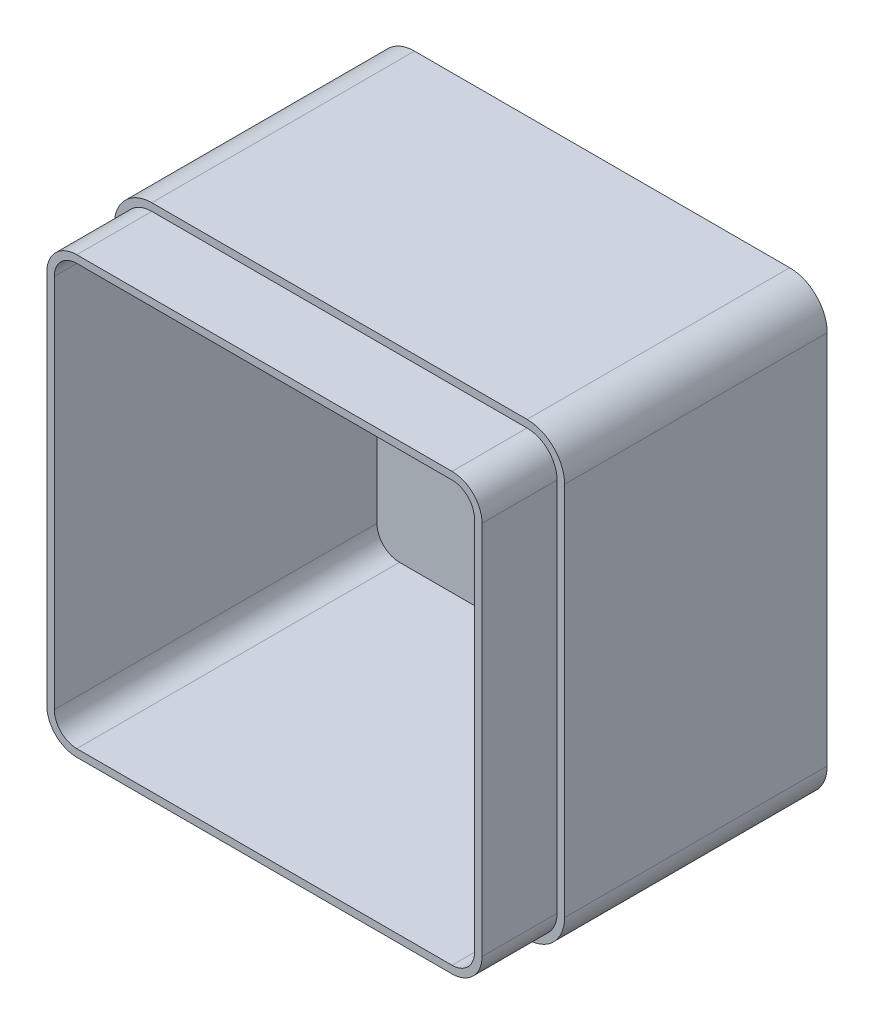
ISO-10303-21;
HEADER;
FILE_DESCRIPTION(('STEP AP214'),'2;1');
FILE_NAME('part.step','',(''),(''),'','','');
FILE_SCHEMA(('AUTOMOTIVE_DESIGN { 1 0 10303 214 1 1 1 1 }'));
ENDSEC;
DATA;
#1=APPLICATION_CONTEXT('core data for automotive mechanical design processes');
#2=APPLICATION_PROTOCOL_DEFINITION('international standard','automotive_design',2000,#1);
#3=PRODUCT_CONTEXT('',#1,'mechanical');
#4=PRODUCT('Part','Part','',(#3));
#5=PRODUCT_RELATED_PRODUCT_CATEGORY('part','',(#4));
#6=PRODUCT_DEFINITION_FORMATION('','',#4);
#7=PRODUCT_DEFINITION_CONTEXT('part definition',#1,'design');
#8=PRODUCT_DEFINITION('design','',#6,#7);
#9=PRODUCT_DEFINITION_SHAPE('','',#8);
#10=(LENGTH_UNIT() NAMED_UNIT(*) SI_UNIT(.MILLI.,.METRE.));
#11=(NAMED_UNIT(*) PLANE_ANGLE_UNIT() SI_UNIT($,.RADIAN.));
#12=(NAMED_UNIT(*) SI_UNIT($,.STERADIAN.) SOLID_ANGLE_UNIT());
#13=UNCERTAINTY_MEASURE_WITH_UNIT(LENGTH_MEASURE(1.E-05),#10,'distance_accuracy_value','');
#14=(GEOMETRIC_REPRESENTATION_CONTEXT(3) GLOBAL_UNCERTAINTY_ASSIGNED_CONTEXT((#13)) GLOBAL_UNIT_ASSIGNED_CONTEXT((#10,
#11,#12)) REPRESENTATION_CONTEXT('',''));
#15=CARTESIAN_POINT('',(0.,0.,0.));
#16=DIRECTION('',(0.,0.,1.));
#17=DIRECTION('',(1.,0.,0.));
#18=AXIS2_PLACEMENT_3D('',#15,#16,#17);
#19=CARTESIAN_POINT('',(0.,0.,90.));
#20=DIRECTION('',(0.,0.,-1.));
#21=DIRECTION('',(-1.,0.,0.));
#22=AXIS2_PLACEMENT_3D('',#19,#20,#21);
#23=PLANE('',#22);
#24=DIRECTION('',(1.,0.,0.));
#25=VECTOR('',#24,1.);
#26=CARTESIAN_POINT('',(0.,4.,90.));
#27=LINE('',#26,#25);
#28=CARTESIAN_POINT('',(9.99999999999999,4.,90.));
#29=VERTEX_POINT('',#28);
#30=CARTESIAN_POINT('',(110.,4.,90.));
#31=VERTEX_POINT('',#30);
#32=EDGE_CURVE('E385',#29,#31,#27,.T.);
#33=ORIENTED_EDGE('',*,*,#32,.F.);
#34=CARTESIAN_POINT('',(10.,10.,90.));
#35=DIRECTION('',(0.,0.,-1.));
#36=DIRECTION('',(-1.,0.,0.));
#37=AXIS2_PLACEMENT_3D('',#34,#35,#36);
#38=CIRCLE('',#37,6.);
#39=CARTESIAN_POINT('',(4.,9.99999999999999,90.));
#40=VERTEX_POINT('',#39);
#41=EDGE_CURVE('E386',#40,#29,#38,.F.);
#42=ORIENTED_EDGE('',*,*,#41,.F.);
#43=DIRECTION('',(0.,-1.,0.));
#44=VECTOR('',#43,1.);
#45=CARTESIAN_POINT('',(4.,0.,90.));
#46=LINE('',#45,#44);
#47=CARTESIAN_POINT('',(4.,110.,90.));
#48=VERTEX_POINT('',#47);
#49=EDGE_CURVE('E358',#48,#40,#46,.T.);
#50=ORIENTED_EDGE('',*,*,#49,.F.);
#51=CARTESIAN_POINT('',(10.,110.,90.));
#52=DIRECTION('',(0.,0.,-1.));
#53=DIRECTION('',(-1.,0.,0.));
#54=AXIS2_PLACEMENT_3D('',#51,#52,#53);
#55=CIRCLE('',#54,6.);
#56=CARTESIAN_POINT('',(9.99999999999999,116.,90.));
#57=VERTEX_POINT('',#56);
#58=EDGE_CURVE('E389',#57,#48,#55,.F.);
#59=ORIENTED_EDGE('',*,*,#58,.F.);
#60=DIRECTION('',(-1.,0.,0.));
#61=VECTOR('',#60,1.);
#62=CARTESIAN_POINT('',(0.,116.,90.));
#63=LINE('',#62,#61);
#64=CARTESIAN_POINT('',(110.,116.,90.));
#65=VERTEX_POINT('',#64);
#66=EDGE_CURVE('E375',#65,#57,#63,.T.);
#67=ORIENTED_EDGE('',*,*,#66,.F.);
#68=CARTESIAN_POINT('',(110.,110.,90.));
#69=DIRECTION('',(0.,0.,-1.));
#70=DIRECTION('',(-1.,0.,0.));
#71=AXIS2_PLACEMENT_3D('',#68,#69,#70);
#72=CIRCLE('',#71,6.);
#73=CARTESIAN_POINT('',(116.,110.,90.));
#74=VERTEX_POINT('',#73);
#75=EDGE_CURVE('E365',#74,#65,#72,.F.);
#76=ORIENTED_EDGE('',*,*,#75,.F.);
#77=DIRECTION('',(0.,1.,0.));
#78=VECTOR('',#77,1.);
#79=CARTESIAN_POINT('',(116.,0.,90.));
#80=LINE('',#79,#78);
#81=CARTESIAN_POINT('',(116.,9.99999999999999,90.));
#82=VERTEX_POINT('',#81);
#83=EDGE_CURVE('E393',#82,#74,#80,.T.);
#84=ORIENTED_EDGE('',*,*,#83,.F.);
#85=CARTESIAN_POINT('',(110.,10.,90.));
#86=DIRECTION('',(0.,0.,-1.));
#87=DIRECTION('',(-1.,0.,0.));
#88=AXIS2_PLACEMENT_3D('',#85,#86,#87);
#89=CIRCLE('',#88,6.);
#90=EDGE_CURVE('E335',#31,#82,#89,.F.);
#91=ORIENTED_EDGE('',*,*,#90,.F.);
#92=EDGE_LOOP('',(#33,#42,#50,#59,#67,#76,#84,#91));
#93=FACE_BOUND('',#92,.T.);
#94=CARTESIAN_POINT('',(10.,10.,90.));
#95=DIRECTION('',(0.,0.,1.));
#96=DIRECTION('',(1.,0.,0.));
#97=AXIS2_PLACEMENT_3D('',#94,#95,#96);
#98=CIRCLE('',#97,8.);
#99=CARTESIAN_POINT('',(2.,9.99999999999999,90.));
#100=VERTEX_POINT('',#99);
#101=CARTESIAN_POINT('',(10.,2.,90.));
#102=VERTEX_POINT('',#101);
#103=EDGE_CURVE('E257',#100,#102,#98,.T.);
#104=ORIENTED_EDGE('',*,*,#103,.T.);
#105=DIRECTION('',(1.,0.,0.));
#106=VECTOR('',#105,1.);
#107=CARTESIAN_POINT('',(10.,2.,90.));
#108=LINE('',#107,#106);
#109=CARTESIAN_POINT('',(110.,2.,90.));
#110=VERTEX_POINT('',#109);
#111=EDGE_CURVE('E207',#102,#110,#108,.T.);
#112=ORIENTED_EDGE('',*,*,#111,.T.);
#113=CARTESIAN_POINT('',(110.,10.,90.));
#114=DIRECTION('',(0.,0.,1.));
#115=DIRECTION('',(1.,0.,0.));
#116=AXIS2_PLACEMENT_3D('',#113,#114,#115);
#117=CIRCLE('',#116,7.99999999999999);
#118=CARTESIAN_POINT('',(118.,10.,90.));
#119=VERTEX_POINT('',#118);
#120=EDGE_CURVE('E55',#110,#119,#117,.T.);
#121=ORIENTED_EDGE('',*,*,#120,.T.);
#122=DIRECTION('',(0.,1.,0.));
#123=VECTOR('',#122,1.);
#124=CARTESIAN_POINT('',(118.,10.,90.));
#125=LINE('',#124,#123);
#126=CARTESIAN_POINT('',(118.,110.,90.));
#127=VERTEX_POINT('',#126);
#128=EDGE_CURVE('E264',#119,#127,#125,.T.);
#129=ORIENTED_EDGE('',*,*,#128,.T.);
#130=CARTESIAN_POINT('',(110.,110.,90.));
#131=DIRECTION('',(0.,0.,1.));
#132=DIRECTION('',(1.,0.,0.));
#133=AXIS2_PLACEMENT_3D('',#130,#131,#132);
#134=CIRCLE('',#133,7.99999999999999);
#135=CARTESIAN_POINT('',(110.,118.,90.));
#136=VERTEX_POINT('',#135);
#137=EDGE_CURVE('E268',#127,#136,#134,.T.);
#138=ORIENTED_EDGE('',*,*,#137,.T.);
#139=DIRECTION('',(-1.,0.,0.));
#140=VECTOR('',#139,1.);
#141=CARTESIAN_POINT('',(110.,118.,90.));
#142=LINE('',#141,#140);
#143=CARTESIAN_POINT('',(9.99999999999999,118.,90.));
#144=VERTEX_POINT('',#143);
#145=EDGE_CURVE('E272',#136,#144,#142,.T.);
#146=ORIENTED_EDGE('',*,*,#145,.T.);
#147=CARTESIAN_POINT('',(10.,110.,90.));
#148=DIRECTION('',(0.,0.,1.));
#149=DIRECTION('',(1.,0.,0.));
#150=AXIS2_PLACEMENT_3D('',#147,#148,#149);
#151=CIRCLE('',#150,7.99999999999999);
#152=CARTESIAN_POINT('',(2.,110.,90.));
#153=VERTEX_POINT('',#152);
#154=EDGE_CURVE('E234',#144,#153,#151,.T.);
#155=ORIENTED_EDGE('',*,*,#154,.T.);
#156=DIRECTION('',(0.,-1.,0.));
#157=VECTOR('',#156,1.);
#158=CARTESIAN_POINT('',(2.,110.,90.));
#159=LINE('',#158,#157);
#160=EDGE_CURVE('E230',#153,#100,#159,.T.);
#161=ORIENTED_EDGE('',*,*,#160,.T.);
#162=EDGE_LOOP('',(#104,#112,#121,#129,#138,#146,#155,#161));
#163=FACE_BOUND('',#162,.T.);
#164=ADVANCED_FACE('F39',(#93,#163),#23,.F.);
#165=CARTESIAN_POINT('',(4.,0.,90.));
#166=DIRECTION('',(1.,0.,0.));
#167=DIRECTION('',(0.,0.,-1.));
#168=AXIS2_PLACEMENT_3D('',#165,#166,#167);
#169=PLANE('',#168);
#170=DIRECTION('',(0.,-1.,0.));
#171=VECTOR('',#170,1.);
#172=CARTESIAN_POINT('',(4.,0.,4.));
#173=LINE('',#172,#171);
#174=CARTESIAN_POINT('',(4.,110.,4.));
#175=VERTEX_POINT('',#174);
#176=CARTESIAN_POINT('',(4.,9.99999999999999,4.));
#177=VERTEX_POINT('',#176);
#178=EDGE_CURVE('E321',#175,#177,#173,.T.);
#179=ORIENTED_EDGE('',*,*,#178,.F.);
#180=DIRECTION('',(0.,0.,-1.));
#181=VECTOR('',#180,1.);
#182=CARTESIAN_POINT('',(4.,110.,90.));
#183=LINE('',#182,#181);
#184=EDGE_CURVE('E331',#48,#175,#183,.T.);
#185=ORIENTED_EDGE('',*,*,#184,.F.);
#186=ORIENTED_EDGE('',*,*,#49,.T.);
#187=DIRECTION('',(0.,0.,-1.));
#188=VECTOR('',#187,1.);
#189=CARTESIAN_POINT('',(4.,9.99999999999999,90.));
#190=LINE('',#189,#188);
#191=EDGE_CURVE('E326',#177,#40,#190,.F.);
#192=ORIENTED_EDGE('',*,*,#191,.F.);
#193=EDGE_LOOP('',(#179,#185,#186,#192));
#194=FACE_BOUND('',#193,.T.);
#195=ADVANCED_FACE('F504',(#194),#169,.T.);
#196=CARTESIAN_POINT('',(0.,4.,90.));
#197=DIRECTION('',(0.,1.,0.));
#198=DIRECTION('',(0.,0.,1.));
#199=AXIS2_PLACEMENT_3D('',#196,#197,#198);
#200=PLANE('',#199);
#201=DIRECTION('',(1.,0.,0.));
#202=VECTOR('',#201,1.);
#203=CARTESIAN_POINT('',(0.,4.,4.));
#204=LINE('',#203,#202);
#205=CARTESIAN_POINT('',(9.99999999999999,4.,4.));
#206=VERTEX_POINT('',#205);
#207=CARTESIAN_POINT('',(110.,4.,4.));
#208=VERTEX_POINT('',#207);
#209=EDGE_CURVE('E325',#206,#208,#204,.T.);
#210=ORIENTED_EDGE('',*,*,#209,.F.);
#211=DIRECTION('',(0.,0.,1.));
#212=VECTOR('',#211,1.);
#213=CARTESIAN_POINT('',(9.99999999999999,4.,90.));
#214=LINE('',#213,#212);
#215=EDGE_CURVE('E344',#29,#206,#214,.F.);
#216=ORIENTED_EDGE('',*,*,#215,.F.);
#217=ORIENTED_EDGE('',*,*,#32,.T.);
#218=DIRECTION('',(0.,0.,1.));
#219=VECTOR('',#218,1.);
#220=CARTESIAN_POINT('',(110.,4.,90.));
#221=LINE('',#220,#219);
#222=EDGE_CURVE('E362',#208,#31,#221,.T.);
#223=ORIENTED_EDGE('',*,*,#222,.F.);
#224=EDGE_LOOP('',(#210,#216,#217,#223));
#225=FACE_BOUND('',#224,.T.);
#226=ADVANCED_FACE('F510',(#225),#200,.T.);
#227=CARTESIAN_POINT('',(116.,0.,90.));
#228=DIRECTION('',(-1.,0.,0.));
#229=DIRECTION('',(0.,0.,1.));
#230=AXIS2_PLACEMENT_3D('',#227,#228,#229);
#231=PLANE('',#230);
#232=ORIENTED_EDGE('',*,*,#83,.T.);
#233=DIRECTION('',(0.,0.,1.));
#234=VECTOR('',#233,1.);
#235=CARTESIAN_POINT('',(116.,110.,90.));
#236=LINE('',#235,#234);
#237=CARTESIAN_POINT('',(116.,110.,4.));
#238=VERTEX_POINT('',#237);
#239=EDGE_CURVE('E372',#238,#74,#236,.T.);
#240=ORIENTED_EDGE('',*,*,#239,.F.);
#241=DIRECTION('',(0.,1.,0.));
#242=VECTOR('',#241,1.);
#243=CARTESIAN_POINT('',(116.,0.,4.));
#244=LINE('',#243,#242);
#245=CARTESIAN_POINT('',(116.,9.99999999999999,4.));
#246=VERTEX_POINT('',#245);
#247=EDGE_CURVE('E336',#246,#238,#244,.T.);
#248=ORIENTED_EDGE('',*,*,#247,.F.);
#249=DIRECTION('',(0.,0.,1.));
#250=VECTOR('',#249,1.);
#251=CARTESIAN_POINT('',(116.,9.99999999999999,90.));
#252=LINE('',#251,#250);
#253=EDGE_CURVE('E361',#82,#246,#252,.F.);
#254=ORIENTED_EDGE('',*,*,#253,.F.);
#255=EDGE_LOOP('',(#232,#240,#248,#254));
#256=FACE_BOUND('',#255,.T.);
#257=ADVANCED_FACE('F704',(#256),#231,.T.);
#258=CARTESIAN_POINT('',(0.,116.,90.));
#259=DIRECTION('',(0.,-1.,0.));
#260=DIRECTION('',(0.,0.,-1.));
#261=AXIS2_PLACEMENT_3D('',#258,#259,#260);
#262=PLANE('',#261);
#263=DIRECTION('',(-1.,0.,0.));
#264=VECTOR('',#263,1.);
#265=CARTESIAN_POINT('',(0.,116.,4.));
#266=LINE('',#265,#264);
#267=CARTESIAN_POINT('',(110.,116.,4.));
#268=VERTEX_POINT('',#267);
#269=CARTESIAN_POINT('',(9.99999999999999,116.,4.));
#270=VERTEX_POINT('',#269);
#271=EDGE_CURVE('E340',#268,#270,#266,.T.);
#272=ORIENTED_EDGE('',*,*,#271,.F.);
#273=DIRECTION('',(0.,0.,-1.));
#274=VECTOR('',#273,1.);
#275=CARTESIAN_POINT('',(110.,116.,90.));
#276=LINE('',#275,#274);
#277=EDGE_CURVE('E330',#65,#268,#276,.T.);
#278=ORIENTED_EDGE('',*,*,#277,.F.);
#279=ORIENTED_EDGE('',*,*,#66,.T.);
#280=DIRECTION('',(0.,0.,-1.));
#281=VECTOR('',#280,1.);
#282=CARTESIAN_POINT('',(9.99999999999999,116.,90.));
#283=LINE('',#282,#281);
#284=EDGE_CURVE('E379',#270,#57,#283,.F.);
#285=ORIENTED_EDGE('',*,*,#284,.F.);
#286=EDGE_LOOP('',(#272,#278,#279,#285));
#287=FACE_BOUND('',#286,.T.);
#288=ADVANCED_FACE('F694',(#287),#262,.T.);
#289=CARTESIAN_POINT('',(0.,0.,4.));
#290=DIRECTION('',(0.,0.,-1.));
#291=DIRECTION('',(-1.,0.,0.));
#292=AXIS2_PLACEMENT_3D('',#289,#290,#291);
#293=PLANE('',#292);
#294=ORIENTED_EDGE('',*,*,#247,.T.);
#295=CARTESIAN_POINT('',(110.,110.,4.));
#296=DIRECTION('',(0.,0.,-1.));
#297=DIRECTION('',(-1.,0.,0.));
#298=AXIS2_PLACEMENT_3D('',#295,#296,#297);
#299=CIRCLE('',#298,6.);
#300=EDGE_CURVE('E354',#268,#238,#299,.T.);
#301=ORIENTED_EDGE('',*,*,#300,.F.);
#302=ORIENTED_EDGE('',*,*,#271,.T.);
#303=CARTESIAN_POINT('',(10.,110.,4.));
#304=DIRECTION('',(0.,0.,-1.));
#305=DIRECTION('',(-1.,0.,0.));
#306=AXIS2_PLACEMENT_3D('',#303,#304,#305);
#307=CIRCLE('',#306,6.);
#308=EDGE_CURVE('E351',#175,#270,#307,.T.);
#309=ORIENTED_EDGE('',*,*,#308,.F.);
#310=ORIENTED_EDGE('',*,*,#178,.T.);
#311=CARTESIAN_POINT('',(10.,10.,4.));
#312=DIRECTION('',(0.,0.,-1.));
#313=DIRECTION('',(-1.,0.,0.));
#314=AXIS2_PLACEMENT_3D('',#311,#312,#313);
#315=CIRCLE('',#314,6.);
#316=EDGE_CURVE('E345',#206,#177,#315,.T.);
#317=ORIENTED_EDGE('',*,*,#316,.F.);
#318=ORIENTED_EDGE('',*,*,#209,.T.);
#319=CARTESIAN_POINT('',(110.,10.,4.));
#320=DIRECTION('',(0.,0.,-1.));
#321=DIRECTION('',(-1.,0.,0.));
#322=AXIS2_PLACEMENT_3D('',#319,#320,#321);
#323=CIRCLE('',#322,6.);
#324=EDGE_CURVE('E341',#246,#208,#323,.T.);
#325=ORIENTED_EDGE('',*,*,#324,.F.);
#326=EDGE_LOOP('',(#294,#301,#302,#309,#310,#317,#318,#325));
#327=FACE_BOUND('',#326,.T.);
#328=ADVANCED_FACE('F684',(#327),#293,.F.);
#329=CARTESIAN_POINT('',(110.,10.,90.));
#330=DIRECTION('',(0.,0.,-1.));
#331=DIRECTION('',(-1.,0.,0.));
#332=AXIS2_PLACEMENT_3D('',#329,#330,#331);
#333=CYLINDRICAL_SURFACE('',#332,6.);
#334=ORIENTED_EDGE('',*,*,#90,.T.);
#335=ORIENTED_EDGE('',*,*,#253,.T.);
#336=ORIENTED_EDGE('',*,*,#324,.T.);
#337=ORIENTED_EDGE('',*,*,#222,.T.);
#338=EDGE_LOOP('',(#334,#335,#336,#337));
#339=FACE_BOUND('',#338,.T.);
#340=ADVANCED_FACE('F674',(#339),#333,.F.);
#341=CARTESIAN_POINT('',(10.,10.,90.));
#342=DIRECTION('',(0.,0.,-1.));
#343=DIRECTION('',(-1.,0.,0.));
#344=AXIS2_PLACEMENT_3D('',#341,#342,#343);
#345=CYLINDRICAL_SURFACE('',#344,6.);
#346=ORIENTED_EDGE('',*,*,#41,.T.);
#347=ORIENTED_EDGE('',*,*,#215,.T.);
#348=ORIENTED_EDGE('',*,*,#316,.T.);
#349=ORIENTED_EDGE('',*,*,#191,.T.);
#350=EDGE_LOOP('',(#346,#347,#348,#349));
#351=FACE_BOUND('',#350,.T.);
#352=ADVANCED_FACE('F665',(#351),#345,.F.);
#353=CARTESIAN_POINT('',(10.,110.,90.));
#354=DIRECTION('',(0.,0.,-1.));
#355=DIRECTION('',(-1.,0.,0.));
#356=AXIS2_PLACEMENT_3D('',#353,#354,#355);
#357=CYLINDRICAL_SURFACE('',#356,6.);
#358=ORIENTED_EDGE('',*,*,#58,.T.);
#359=ORIENTED_EDGE('',*,*,#184,.T.);
#360=ORIENTED_EDGE('',*,*,#308,.T.);
#361=ORIENTED_EDGE('',*,*,#284,.T.);
#362=EDGE_LOOP('',(#358,#359,#360,#361));
#363=FACE_BOUND('',#362,.T.);
#364=ADVANCED_FACE('F656',(#363),#357,.F.);
#365=CARTESIAN_POINT('',(110.,110.,90.));
#366=DIRECTION('',(0.,0.,-1.));
#367=DIRECTION('',(-1.,0.,0.));
#368=AXIS2_PLACEMENT_3D('',#365,#366,#367);
#369=CYLINDRICAL_SURFACE('',#368,6.);
#370=ORIENTED_EDGE('',*,*,#75,.T.);
#371=ORIENTED_EDGE('',*,*,#277,.T.);
#372=ORIENTED_EDGE('',*,*,#300,.T.);
#373=ORIENTED_EDGE('',*,*,#239,.T.);
#374=EDGE_LOOP('',(#370,#371,#372,#373));
#375=FACE_BOUND('',#374,.T.);
#376=ADVANCED_FACE('F517',(#375),#369,.F.);
#377=CARTESIAN_POINT('',(10.,10.,70.));
#378=DIRECTION('',(0.,0.,1.));
#379=DIRECTION('',(1.,0.,0.));
#380=AXIS2_PLACEMENT_3D('',#377,#378,#379);
#381=PLANE('',#380);
#382=DIRECTION('',(0.,-1.,0.));
#383=VECTOR('',#382,1.);
#384=CARTESIAN_POINT('',(2.,110.,70.));
#385=LINE('',#384,#383);
#386=CARTESIAN_POINT('',(2.,110.,70.));
#387=VERTEX_POINT('',#386);
#388=CARTESIAN_POINT('',(2.,9.99999999999999,70.));
#389=VERTEX_POINT('',#388);
#390=EDGE_CURVE('E214',#387,#389,#385,.T.);
#391=ORIENTED_EDGE('',*,*,#390,.F.);
#392=CARTESIAN_POINT('',(10.,110.,70.));
#393=DIRECTION('',(0.,0.,1.));
#394=DIRECTION('',(1.,0.,0.));
#395=AXIS2_PLACEMENT_3D('',#392,#393,#394);
#396=CIRCLE('',#395,7.99999999999999);
#397=CARTESIAN_POINT('',(9.99999999999999,118.,70.));
#398=VERTEX_POINT('',#397);
#399=EDGE_CURVE('E251',#398,#387,#396,.T.);
#400=ORIENTED_EDGE('',*,*,#399,.F.);
#401=DIRECTION('',(-1.,0.,0.));
#402=VECTOR('',#401,1.);
#403=CARTESIAN_POINT('',(110.,118.,70.));
#404=LINE('',#403,#402);
#405=CARTESIAN_POINT('',(110.,118.,70.));
#406=VERTEX_POINT('',#405);
#407=EDGE_CURVE('E247',#406,#398,#404,.T.);
#408=ORIENTED_EDGE('',*,*,#407,.F.);
#409=CARTESIAN_POINT('',(110.,110.,70.));
#410=DIRECTION('',(0.,0.,1.));
#411=DIRECTION('',(1.,0.,0.));
#412=AXIS2_PLACEMENT_3D('',#409,#410,#411);
#413=CIRCLE('',#412,7.99999999999999);
#414=CARTESIAN_POINT('',(118.,110.,70.));
#415=VERTEX_POINT('',#414);
#416=EDGE_CURVE('E243',#415,#406,#413,.T.);
#417=ORIENTED_EDGE('',*,*,#416,.F.);
#418=DIRECTION('',(0.,1.,0.));
#419=VECTOR('',#418,1.);
#420=CARTESIAN_POINT('',(118.,10.,70.));
#421=LINE('',#420,#419);
#422=CARTESIAN_POINT('',(118.,10.,70.));
#423=VERTEX_POINT('',#422);
#424=EDGE_CURVE('E239',#423,#415,#421,.T.);
#425=ORIENTED_EDGE('',*,*,#424,.F.);
#426=CARTESIAN_POINT('',(110.,10.,70.));
#427=DIRECTION('',(0.,0.,1.));
#428=DIRECTION('',(1.,0.,0.));
#429=AXIS2_PLACEMENT_3D('',#426,#427,#428);
#430=CIRCLE('',#429,7.99999999999999);
#431=CARTESIAN_POINT('',(110.,2.,70.));
#432=VERTEX_POINT('',#431);
#433=EDGE_CURVE('E224',#432,#423,#430,.T.);
#434=ORIENTED_EDGE('',*,*,#433,.F.);
#435=DIRECTION('',(1.,0.,0.));
#436=VECTOR('',#435,1.);
#437=CARTESIAN_POINT('',(10.,2.,70.));
#438=LINE('',#437,#436);
#439=CARTESIAN_POINT('',(10.,2.,70.));
#440=VERTEX_POINT('',#439);
#441=EDGE_CURVE('E205',#440,#432,#438,.T.);
#442=ORIENTED_EDGE('',*,*,#441,.F.);
#443=CARTESIAN_POINT('',(10.,10.,70.));
#444=DIRECTION('',(0.,0.,1.));
#445=DIRECTION('',(1.,0.,0.));
#446=AXIS2_PLACEMENT_3D('',#443,#444,#445);
#447=CIRCLE('',#446,8.);
#448=EDGE_CURVE('E220',#389,#440,#447,.T.);
#449=ORIENTED_EDGE('',*,*,#448,.F.);
#450=EDGE_LOOP('',(#391,#400,#408,#417,#425,#434,#442,#449));
#451=FACE_BOUND('',#450,.T.);
#452=CARTESIAN_POINT('',(10.,10.,70.));
#453=DIRECTION('',(0.,0.,1.));
#454=DIRECTION('',(1.,0.,0.));
#455=AXIS2_PLACEMENT_3D('',#452,#453,#454);
#456=CIRCLE('',#455,10.);
#457=CARTESIAN_POINT('',(0.,9.99999999999999,70.));
#458=VERTEX_POINT('',#457);
#459=CARTESIAN_POINT('',(10.,0.,70.));
#460=VERTEX_POINT('',#459);
#461=EDGE_CURVE('E281',#458,#460,#456,.T.);
#462=ORIENTED_EDGE('',*,*,#461,.T.);
#463=DIRECTION('',(1.,0.,0.));
#464=VECTOR('',#463,1.);
#465=CARTESIAN_POINT('',(10.,0.,70.));
#466=LINE('',#465,#464);
#467=CARTESIAN_POINT('',(110.,0.,70.));
#468=VERTEX_POINT('',#467);
#469=EDGE_CURVE('E301',#460,#468,#466,.T.);
#470=ORIENTED_EDGE('',*,*,#469,.T.);
#471=CARTESIAN_POINT('',(110.,10.,70.));
#472=DIRECTION('',(0.,0.,1.));
#473=DIRECTION('',(1.,0.,0.));
#474=AXIS2_PLACEMENT_3D('',#471,#472,#473);
#475=CIRCLE('',#474,9.99999999999999);
#476=CARTESIAN_POINT('',(120.,10.,70.));
#477=VERTEX_POINT('',#476);
#478=EDGE_CURVE('E304',#468,#477,#475,.T.);
#479=ORIENTED_EDGE('',*,*,#478,.T.);
#480=DIRECTION('',(0.,1.,0.));
#481=VECTOR('',#480,1.);
#482=CARTESIAN_POINT('',(120.,10.,70.));
#483=LINE('',#482,#481);
#484=CARTESIAN_POINT('',(120.,110.,70.));
#485=VERTEX_POINT('',#484);
#486=EDGE_CURVE('E63',#477,#485,#483,.T.);
#487=ORIENTED_EDGE('',*,*,#486,.T.);
#488=CARTESIAN_POINT('',(110.,110.,70.));
#489=DIRECTION('',(0.,0.,1.));
#490=DIRECTION('',(1.,0.,0.));
#491=AXIS2_PLACEMENT_3D('',#488,#489,#490);
#492=CIRCLE('',#491,9.99999999999999);
#493=CARTESIAN_POINT('',(110.,120.,70.));
#494=VERTEX_POINT('',#493);
#495=EDGE_CURVE('E309',#485,#494,#492,.T.);
#496=ORIENTED_EDGE('',*,*,#495,.T.);
#497=DIRECTION('',(-1.,0.,0.));
#498=VECTOR('',#497,1.);
#499=CARTESIAN_POINT('',(110.,120.,70.));
#500=LINE('',#499,#498);
#501=CARTESIAN_POINT('',(10.,120.,70.));
#502=VERTEX_POINT('',#501);
#503=EDGE_CURVE('E312',#494,#502,#500,.T.);
#504=ORIENTED_EDGE('',*,*,#503,.T.);
#505=CARTESIAN_POINT('',(10.,110.,70.));
#506=DIRECTION('',(0.,0.,1.));
#507=DIRECTION('',(1.,0.,0.));
#508=AXIS2_PLACEMENT_3D('',#505,#506,#507);
#509=CIRCLE('',#508,9.99999999999999);
#510=CARTESIAN_POINT('',(0.,110.,70.));
#511=VERTEX_POINT('',#510);
#512=EDGE_CURVE('E315',#502,#511,#509,.T.);
#513=ORIENTED_EDGE('',*,*,#512,.T.);
#514=DIRECTION('',(0.,-1.,0.));
#515=VECTOR('',#514,1.);
#516=CARTESIAN_POINT('',(0.,110.,70.));
#517=LINE('',#516,#515);
#518=EDGE_CURVE('E318',#511,#458,#517,.T.);
#519=ORIENTED_EDGE('',*,*,#518,.T.);
#520=EDGE_LOOP('',(#462,#470,#479,#487,#496,#504,#513,#519));
#521=FACE_BOUND('',#520,.T.);
#522=ADVANCED_FACE('F219',(#451,#521),#381,.T.);
#523=CARTESIAN_POINT('',(10.,10.,70.));
#524=DIRECTION('',(0.,0.,1.));
#525=DIRECTION('',(1.,0.,0.));
#526=AXIS2_PLACEMENT_3D('',#523,#524,#525);
#527=CYLINDRICAL_SURFACE('',#526,8.);
#528=ORIENTED_EDGE('',*,*,#103,.F.);
#529=DIRECTION('',(0.,0.,1.));
#530=VECTOR('',#529,1.);
#531=CARTESIAN_POINT('',(2.,9.99999999999999,70.));
#532=LINE('',#531,#530);
#533=EDGE_CURVE('E228',#389,#100,#532,.T.);
#534=ORIENTED_EDGE('',*,*,#533,.F.);
#535=ORIENTED_EDGE('',*,*,#448,.T.);
#536=DIRECTION('',(0.,0.,1.));
#537=VECTOR('',#536,1.);
#538=CARTESIAN_POINT('',(10.,2.,70.));
#539=LINE('',#538,#537);
#540=EDGE_CURVE('E202',#440,#102,#539,.T.);
#541=ORIENTED_EDGE('',*,*,#540,.T.);
#542=EDGE_LOOP('',(#528,#534,#535,#541));
#543=FACE_BOUND('',#542,.T.);
#544=ADVANCED_FACE('F227',(#543),#527,.T.);
#545=CARTESIAN_POINT('',(2.,110.,70.));
#546=DIRECTION('',(-1.,0.,0.));
#547=DIRECTION('',(0.,-1.,0.));
#548=AXIS2_PLACEMENT_3D('',#545,#546,#547);
#549=PLANE('',#548);
#550=ORIENTED_EDGE('',*,*,#160,.F.);
#551=DIRECTION('',(0.,0.,1.));
#552=VECTOR('',#551,1.);
#553=CARTESIAN_POINT('',(2.,110.,70.));
#554=LINE('',#553,#552);
#555=EDGE_CURVE('E282',#387,#153,#554,.T.);
#556=ORIENTED_EDGE('',*,*,#555,.F.);
#557=ORIENTED_EDGE('',*,*,#390,.T.);
#558=ORIENTED_EDGE('',*,*,#533,.T.);
#559=EDGE_LOOP('',(#550,#556,#557,#558));
#560=FACE_BOUND('',#559,.T.);
#561=ADVANCED_FACE('F560',(#560),#549,.T.);
#562=CARTESIAN_POINT('',(10.,110.,70.));
#563=DIRECTION('',(0.,0.,1.));
#564=DIRECTION('',(1.,0.,0.));
#565=AXIS2_PLACEMENT_3D('',#562,#563,#564);
#566=CYLINDRICAL_SURFACE('',#565,7.99999999999999);
#567=ORIENTED_EDGE('',*,*,#154,.F.);
#568=DIRECTION('',(0.,0.,1.));
#569=VECTOR('',#568,1.);
#570=CARTESIAN_POINT('',(9.99999999999999,118.,70.));
#571=LINE('',#570,#569);
#572=EDGE_CURVE('E285',#398,#144,#571,.T.);
#573=ORIENTED_EDGE('',*,*,#572,.F.);
#574=ORIENTED_EDGE('',*,*,#399,.T.);
#575=ORIENTED_EDGE('',*,*,#555,.T.);
#576=EDGE_LOOP('',(#567,#573,#574,#575));
#577=FACE_BOUND('',#576,.T.);
#578=ADVANCED_FACE('F568',(#577),#566,.T.);
#579=CARTESIAN_POINT('',(110.,118.,70.));
#580=DIRECTION('',(0.,1.,0.));
#581=DIRECTION('',(0.,0.,1.));
#582=AXIS2_PLACEMENT_3D('',#579,#580,#581);
#583=PLANE('',#582);
#584=ORIENTED_EDGE('',*,*,#145,.F.);
#585=DIRECTION('',(0.,0.,1.));
#586=VECTOR('',#585,1.);
#587=CARTESIAN_POINT('',(110.,118.,70.));
#588=LINE('',#587,#586);
#589=EDGE_CURVE('E288',#406,#136,#588,.T.);
#590=ORIENTED_EDGE('',*,*,#589,.F.);
#591=ORIENTED_EDGE('',*,*,#407,.T.);
#592=ORIENTED_EDGE('',*,*,#572,.T.);
#593=EDGE_LOOP('',(#584,#590,#591,#592));
#594=FACE_BOUND('',#593,.T.);
#595=ADVANCED_FACE('F577',(#594),#583,.T.);
#596=CARTESIAN_POINT('',(110.,110.,70.));
#597=DIRECTION('',(0.,0.,1.));
#598=DIRECTION('',(1.,0.,0.));
#599=AXIS2_PLACEMENT_3D('',#596,#597,#598);
#600=CYLINDRICAL_SURFACE('',#599,7.99999999999999);
#601=ORIENTED_EDGE('',*,*,#137,.F.);
#602=DIRECTION('',(0.,0.,1.));
#603=VECTOR('',#602,1.);
#604=CARTESIAN_POINT('',(118.,110.,70.));
#605=LINE('',#604,#603);
#606=EDGE_CURVE('E291',#415,#127,#605,.T.);
#607=ORIENTED_EDGE('',*,*,#606,.F.);
#608=ORIENTED_EDGE('',*,*,#416,.T.);
#609=ORIENTED_EDGE('',*,*,#589,.T.);
#610=EDGE_LOOP('',(#601,#607,#608,#609));
#611=FACE_BOUND('',#610,.T.);
#612=ADVANCED_FACE('F586',(#611),#600,.T.);
#613=CARTESIAN_POINT('',(118.,10.,70.));
#614=DIRECTION('',(1.,0.,0.));
#615=DIRECTION('',(0.,0.,-1.));
#616=AXIS2_PLACEMENT_3D('',#613,#614,#615);
#617=PLANE('',#616);
#618=ORIENTED_EDGE('',*,*,#128,.F.);
#619=DIRECTION('',(0.,0.,1.));
#620=VECTOR('',#619,1.);
#621=CARTESIAN_POINT('',(118.,10.,70.));
#622=LINE('',#621,#620);
#623=EDGE_CURVE('E294',#423,#119,#622,.T.);
#624=ORIENTED_EDGE('',*,*,#623,.F.);
#625=ORIENTED_EDGE('',*,*,#424,.T.);
#626=ORIENTED_EDGE('',*,*,#606,.T.);
#627=EDGE_LOOP('',(#618,#624,#625,#626));
#628=FACE_BOUND('',#627,.T.);
#629=ADVANCED_FACE('F595',(#628),#617,.T.);
#630=CARTESIAN_POINT('',(110.,10.,70.));
#631=DIRECTION('',(0.,0.,1.));
#632=DIRECTION('',(1.,0.,0.));
#633=AXIS2_PLACEMENT_3D('',#630,#631,#632);
#634=CYLINDRICAL_SURFACE('',#633,7.99999999999999);
#635=ORIENTED_EDGE('',*,*,#120,.F.);
#636=DIRECTION('',(0.,0.,1.));
#637=VECTOR('',#636,1.);
#638=CARTESIAN_POINT('',(110.,2.,70.));
#639=LINE('',#638,#637);
#640=EDGE_CURVE('E213',#432,#110,#639,.T.);
#641=ORIENTED_EDGE('',*,*,#640,.F.);
#642=ORIENTED_EDGE('',*,*,#433,.T.);
#643=ORIENTED_EDGE('',*,*,#623,.T.);
#644=EDGE_LOOP('',(#635,#641,#642,#643));
#645=FACE_BOUND('',#644,.T.);
#646=ADVANCED_FACE('F604',(#645),#634,.T.);
#647=CARTESIAN_POINT('',(10.,2.,70.));
#648=DIRECTION('',(0.,-1.,0.));
#649=DIRECTION('',(0.,0.,-1.));
#650=AXIS2_PLACEMENT_3D('',#647,#648,#649);
#651=PLANE('',#650);
#652=ORIENTED_EDGE('',*,*,#111,.F.);
#653=ORIENTED_EDGE('',*,*,#540,.F.);
#654=ORIENTED_EDGE('',*,*,#441,.T.);
#655=ORIENTED_EDGE('',*,*,#640,.T.);
#656=EDGE_LOOP('',(#652,#653,#654,#655));
#657=FACE_BOUND('',#656,.T.);
#658=ADVANCED_FACE('F204',(#657),#651,.T.);
#659=CARTESIAN_POINT('',(0.,0.,0.));
#660=DIRECTION('',(0.,0.,-1.));
#661=DIRECTION('',(-1.,0.,0.));
#662=AXIS2_PLACEMENT_3D('',#659,#660,#661);
#663=PLANE('',#662);
#664=DIRECTION('',(0.,1.,0.));
#665=VECTOR('',#664,1.);
#666=CARTESIAN_POINT('',(120.,0.,0.));
#667=LINE('',#666,#665);
#668=CARTESIAN_POINT('',(120.,9.99999999999999,0.));
#669=VERTEX_POINT('',#668);
#670=CARTESIAN_POINT('',(120.,110.,0.));
#671=VERTEX_POINT('',#670);
#672=EDGE_CURVE('E413',#669,#671,#667,.T.);
#673=ORIENTED_EDGE('',*,*,#672,.F.);
#674=CARTESIAN_POINT('',(110.,10.,0.));
#675=DIRECTION('',(0.,0.,-1.));
#676=DIRECTION('',(-1.,0.,0.));
#677=AXIS2_PLACEMENT_3D('',#674,#675,#676);
#678=CIRCLE('',#677,10.);
#679=CARTESIAN_POINT('',(110.,0.,0.));
#680=VERTEX_POINT('',#679);
#681=EDGE_CURVE('E437',#669,#680,#678,.T.);
#682=ORIENTED_EDGE('',*,*,#681,.T.);
#683=DIRECTION('',(1.,0.,0.));
#684=VECTOR('',#683,1.);
#685=CARTESIAN_POINT('',(0.,0.,0.));
#686=LINE('',#685,#684);
#687=CARTESIAN_POINT('',(10.,0.,0.));
#688=VERTEX_POINT('',#687);
#689=EDGE_CURVE('E409',#688,#680,#686,.T.);
#690=ORIENTED_EDGE('',*,*,#689,.F.);
#691=CARTESIAN_POINT('',(10.,10.,0.));
#692=DIRECTION('',(0.,0.,-1.));
#693=DIRECTION('',(-1.,0.,0.));
#694=AXIS2_PLACEMENT_3D('',#691,#692,#693);
#695=CIRCLE('',#694,10.);
#696=CARTESIAN_POINT('',(0.,9.99999999999999,0.));
#697=VERTEX_POINT('',#696);
#698=EDGE_CURVE('E434',#688,#697,#695,.T.);
#699=ORIENTED_EDGE('',*,*,#698,.T.);
#700=DIRECTION('',(0.,-1.,0.));
#701=VECTOR('',#700,1.);
#702=CARTESIAN_POINT('',(0.,0.,0.));
#703=LINE('',#702,#701);
#704=CARTESIAN_POINT('',(0.,110.,0.));
#705=VERTEX_POINT('',#704);
#706=EDGE_CURVE('E382',#705,#697,#703,.T.);
#707=ORIENTED_EDGE('',*,*,#706,.F.);
#708=CARTESIAN_POINT('',(10.,110.,0.));
#709=DIRECTION('',(0.,0.,-1.));
#710=DIRECTION('',(-1.,0.,0.));
#711=AXIS2_PLACEMENT_3D('',#708,#709,#710);
#712=CIRCLE('',#711,10.);
#713=CARTESIAN_POINT('',(10.,120.,0.));
#714=VERTEX_POINT('',#713);
#715=EDGE_CURVE('E431',#705,#714,#712,.T.);
#716=ORIENTED_EDGE('',*,*,#715,.T.);
#717=DIRECTION('',(-1.,0.,0.));
#718=VECTOR('',#717,1.);
#719=CARTESIAN_POINT('',(0.,120.,0.));
#720=LINE('',#719,#718);
#721=CARTESIAN_POINT('',(110.,120.,0.));
#722=VERTEX_POINT('',#721);
#723=EDGE_CURVE('E417',#722,#714,#720,.T.);
#724=ORIENTED_EDGE('',*,*,#723,.F.);
#725=CARTESIAN_POINT('',(110.,110.,0.));
#726=DIRECTION('',(0.,0.,-1.));
#727=DIRECTION('',(-1.,0.,0.));
#728=AXIS2_PLACEMENT_3D('',#725,#726,#727);
#729=CIRCLE('',#728,10.);
#730=EDGE_CURVE('E428',#722,#671,#729,.T.);
#731=ORIENTED_EDGE('',*,*,#730,.T.);
#732=EDGE_LOOP('',(#673,#682,#690,#699,#707,#716,#724,#731));
#733=FACE_BOUND('',#732,.T.);
#734=ADVANCED_FACE('F465',(#733),#663,.T.);
#735=CARTESIAN_POINT('',(10.,110.,90.));
#736=DIRECTION('',(0.,0.,-1.));
#737=DIRECTION('',(-1.,0.,0.));
#738=AXIS2_PLACEMENT_3D('',#735,#736,#737);
#739=CYLINDRICAL_SURFACE('',#738,10.);
#740=DIRECTION('',(0.,0.,-1.));
#741=VECTOR('',#740,1.);
#742=CARTESIAN_POINT('',(0.,110.,90.));
#743=LINE('',#742,#741);
#744=EDGE_CURVE('E447',#511,#705,#743,.T.);
#745=ORIENTED_EDGE('',*,*,#744,.F.);
#746=ORIENTED_EDGE('',*,*,#512,.F.);
#747=DIRECTION('',(0.,0.,-1.));
#748=VECTOR('',#747,1.);
#749=CARTESIAN_POINT('',(10.,120.,90.));
#750=LINE('',#749,#748);
#751=EDGE_CURVE('E11',#714,#502,#750,.F.);
#752=ORIENTED_EDGE('',*,*,#751,.F.);
#753=ORIENTED_EDGE('',*,*,#715,.F.);
#754=EDGE_LOOP('',(#745,#746,#752,#753));
#755=FACE_BOUND('',#754,.T.);
#756=ADVANCED_FACE('F470',(#755),#739,.T.);
#757=CARTESIAN_POINT('',(110.,110.,90.));
#758=DIRECTION('',(0.,0.,-1.));
#759=DIRECTION('',(-1.,0.,0.));
#760=AXIS2_PLACEMENT_3D('',#757,#758,#759);
#761=CYLINDRICAL_SURFACE('',#760,10.);
#762=DIRECTION('',(0.,0.,-1.));
#763=VECTOR('',#762,1.);
#764=CARTESIAN_POINT('',(110.,120.,90.));
#765=LINE('',#764,#763);
#766=EDGE_CURVE('E48',#494,#722,#765,.T.);
#767=ORIENTED_EDGE('',*,*,#766,.F.);
#768=ORIENTED_EDGE('',*,*,#495,.F.);
#769=DIRECTION('',(0.,0.,-1.));
#770=VECTOR('',#769,1.);
#771=CARTESIAN_POINT('',(120.,110.,90.));
#772=LINE('',#771,#770);
#773=EDGE_CURVE('E421',#671,#485,#772,.F.);
#774=ORIENTED_EDGE('',*,*,#773,.F.);
#775=ORIENTED_EDGE('',*,*,#730,.F.);
#776=EDGE_LOOP('',(#767,#768,#774,#775));
#777=FACE_BOUND('',#776,.T.);
#778=ADVANCED_FACE('F41',(#777),#761,.T.);
#779=CARTESIAN_POINT('',(0.,120.,90.));
#780=DIRECTION('',(0.,-1.,0.));
#781=DIRECTION('',(0.,0.,-1.));
#782=AXIS2_PLACEMENT_3D('',#779,#780,#781);
#783=PLANE('',#782);
#784=ORIENTED_EDGE('',*,*,#503,.F.);
#785=ORIENTED_EDGE('',*,*,#766,.T.);
#786=ORIENTED_EDGE('',*,*,#723,.T.);
#787=ORIENTED_EDGE('',*,*,#751,.T.);
#788=EDGE_LOOP('',(#784,#785,#786,#787));
#789=FACE_BOUND('',#788,.T.);
#790=ADVANCED_FACE('F458',(#789),#783,.F.);
#791=CARTESIAN_POINT('',(110.,10.,90.));
#792=DIRECTION('',(0.,0.,-1.));
#793=DIRECTION('',(-1.,0.,0.));
#794=AXIS2_PLACEMENT_3D('',#791,#792,#793);
#795=CYLINDRICAL_SURFACE('',#794,10.);
#796=DIRECTION('',(0.,0.,-1.));
#797=VECTOR('',#796,1.);
#798=CARTESIAN_POINT('',(120.,10.,90.));
#799=LINE('',#798,#797);
#800=EDGE_CURVE('E425',#477,#669,#799,.T.);
#801=ORIENTED_EDGE('',*,*,#800,.F.);
#802=ORIENTED_EDGE('',*,*,#478,.F.);
#803=DIRECTION('',(0.,0.,-1.));
#804=VECTOR('',#803,1.);
#805=CARTESIAN_POINT('',(110.,0.,90.));
#806=LINE('',#805,#804);
#807=EDGE_CURVE('E443',#680,#468,#806,.F.);
#808=ORIENTED_EDGE('',*,*,#807,.F.);
#809=ORIENTED_EDGE('',*,*,#681,.F.);
#810=EDGE_LOOP('',(#801,#802,#808,#809));
#811=FACE_BOUND('',#810,.T.);
#812=ADVANCED_FACE('F490',(#811),#795,.T.);
#813=CARTESIAN_POINT('',(120.,0.,90.));
#814=DIRECTION('',(-1.,0.,0.));
#815=DIRECTION('',(0.,0.,1.));
#816=AXIS2_PLACEMENT_3D('',#813,#814,#815);
#817=PLANE('',#816);
#818=ORIENTED_EDGE('',*,*,#486,.F.);
#819=ORIENTED_EDGE('',*,*,#800,.T.);
#820=ORIENTED_EDGE('',*,*,#672,.T.);
#821=ORIENTED_EDGE('',*,*,#773,.T.);
#822=EDGE_LOOP('',(#818,#819,#820,#821));
#823=FACE_BOUND('',#822,.T.);
#824=ADVANCED_FACE('F492',(#823),#817,.F.);
#825=CARTESIAN_POINT('',(10.,10.,90.));
#826=DIRECTION('',(0.,0.,-1.));
#827=DIRECTION('',(-1.,0.,0.));
#828=AXIS2_PLACEMENT_3D('',#825,#826,#827);
#829=CYLINDRICAL_SURFACE('',#828,10.);
#830=DIRECTION('',(0.,0.,-1.));
#831=VECTOR('',#830,1.);
#832=CARTESIAN_POINT('',(10.,0.,90.));
#833=LINE('',#832,#831);
#834=EDGE_CURVE('E440',#460,#688,#833,.T.);
#835=ORIENTED_EDGE('',*,*,#834,.F.);
#836=ORIENTED_EDGE('',*,*,#461,.F.);
#837=DIRECTION('',(0.,0.,-1.));
#838=VECTOR('',#837,1.);
#839=CARTESIAN_POINT('',(0.,10.,90.));
#840=LINE('',#839,#838);
#841=EDGE_CURVE('E450',#697,#458,#840,.F.);
#842=ORIENTED_EDGE('',*,*,#841,.F.);
#843=ORIENTED_EDGE('',*,*,#698,.F.);
#844=EDGE_LOOP('',(#835,#836,#842,#843));
#845=FACE_BOUND('',#844,.T.);
#846=ADVANCED_FACE('F480',(#845),#829,.T.);
#847=CARTESIAN_POINT('',(0.,0.,90.));
#848=DIRECTION('',(0.,1.,0.));
#849=DIRECTION('',(0.,0.,1.));
#850=AXIS2_PLACEMENT_3D('',#847,#848,#849);
#851=PLANE('',#850);
#852=ORIENTED_EDGE('',*,*,#469,.F.);
#853=ORIENTED_EDGE('',*,*,#834,.T.);
#854=ORIENTED_EDGE('',*,*,#689,.T.);
#855=ORIENTED_EDGE('',*,*,#807,.T.);
#856=EDGE_LOOP('',(#852,#853,#854,#855));
#857=FACE_BOUND('',#856,.T.);
#858=ADVANCED_FACE('F485',(#857),#851,.F.);
#859=CARTESIAN_POINT('',(0.,0.,90.));
#860=DIRECTION('',(1.,0.,0.));
#861=DIRECTION('',(0.,0.,-1.));
#862=AXIS2_PLACEMENT_3D('',#859,#860,#861);
#863=PLANE('',#862);
#864=ORIENTED_EDGE('',*,*,#518,.F.);
#865=ORIENTED_EDGE('',*,*,#744,.T.);
#866=ORIENTED_EDGE('',*,*,#706,.T.);
#867=ORIENTED_EDGE('',*,*,#841,.T.);
#868=EDGE_LOOP('',(#864,#865,#866,#867));
#869=FACE_BOUND('',#868,.T.);
#870=ADVANCED_FACE('F475',(#869),#863,.F.);
#871=CLOSED_SHELL('',(#164,#195,#226,#257,#288,#328,#340,#352,#364,#376,#522,#544,#561,#578,
#595,#612,#629,#646,#658,#734,#756,#778,#790,#812,#824,#846,#858,#870));
#872=MANIFOLD_SOLID_BREP('B2',#871);
#873=ADVANCED_BREP_SHAPE_REPRESENTATION('',(#18,#872),#14);
#874=SHAPE_DEFINITION_REPRESENTATION(#9,#873);
ENDSEC;
END-ISO-10303-21;
